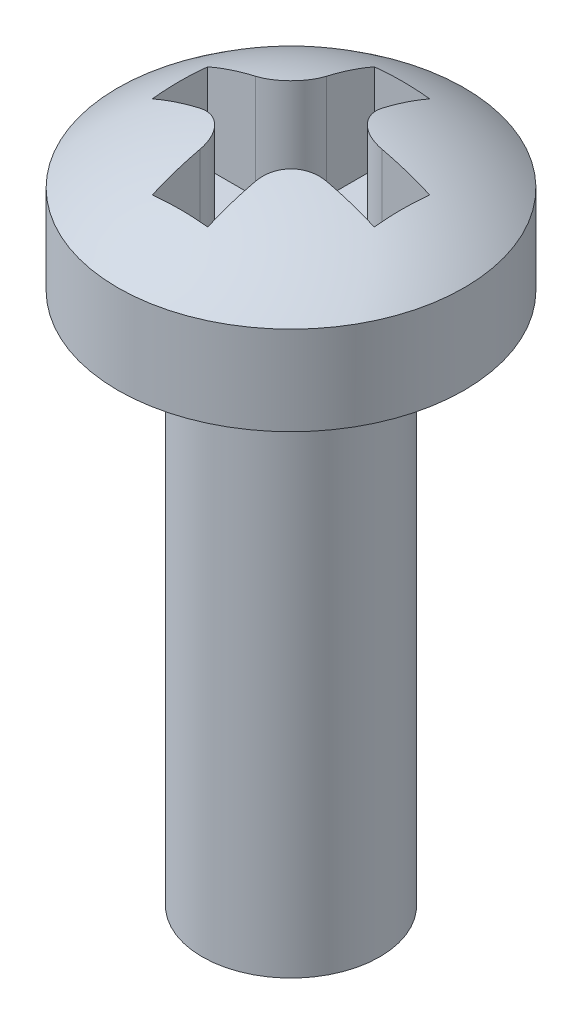
ISO-10303-21;
HEADER;
FILE_DESCRIPTION(('STEP AP214'),'2;1');
FILE_NAME('part.step','',(''),(''),'','','');
FILE_SCHEMA(('AUTOMOTIVE_DESIGN { 1 0 10303 214 1 1 1 1 }'));
ENDSEC;
DATA;
#1=APPLICATION_CONTEXT('core data for automotive mechanical design processes');
#2=APPLICATION_PROTOCOL_DEFINITION('international standard','automotive_design',2000,#1);
#3=PRODUCT_CONTEXT('',#1,'mechanical');
#4=PRODUCT('Part','Part','',(#3));
#5=PRODUCT_RELATED_PRODUCT_CATEGORY('part','',(#4));
#6=PRODUCT_DEFINITION_FORMATION('','',#4);
#7=PRODUCT_DEFINITION_CONTEXT('part definition',#1,'design');
#8=PRODUCT_DEFINITION('design','',#6,#7);
#9=PRODUCT_DEFINITION_SHAPE('','',#8);
#10=(LENGTH_UNIT() NAMED_UNIT(*) SI_UNIT(.MILLI.,.METRE.));
#11=(NAMED_UNIT(*) PLANE_ANGLE_UNIT() SI_UNIT($,.RADIAN.));
#12=(NAMED_UNIT(*) SI_UNIT($,.STERADIAN.) SOLID_ANGLE_UNIT());
#13=UNCERTAINTY_MEASURE_WITH_UNIT(LENGTH_MEASURE(1.E-05),#10,'distance_accuracy_value','');
#14=(GEOMETRIC_REPRESENTATION_CONTEXT(3) GLOBAL_UNCERTAINTY_ASSIGNED_CONTEXT((#13)) GLOBAL_UNIT_ASSIGNED_CONTEXT((#10,
#11,#12)) REPRESENTATION_CONTEXT('',''));
#15=CARTESIAN_POINT('',(0.,0.,0.));
#16=DIRECTION('',(0.,0.,1.));
#17=DIRECTION('',(1.,0.,0.));
#18=AXIS2_PLACEMENT_3D('',#15,#16,#17);
#19=CARTESIAN_POINT('',(0.,12.,0.));
#20=DIRECTION('',(0.,-1.,0.));
#21=DIRECTION('',(0.,0.,-1.));
#22=AXIS2_PLACEMENT_3D('',#19,#20,#21);
#23=CYLINDRICAL_SURFACE('',#22,2.);
#24=CARTESIAN_POINT('',(0.,12.,0.));
#25=DIRECTION('',(0.,1.,0.));
#26=DIRECTION('',(0.,0.,1.));
#27=AXIS2_PLACEMENT_3D('',#24,#25,#26);
#28=CIRCLE('',#27,2.);
#29=CARTESIAN_POINT('',(0.,12.,2.));
#30=VERTEX_POINT('',#29);
#31=EDGE_CURVE('E196',#30,#30,#28,.T.);
#32=ORIENTED_EDGE('',*,*,#31,.F.);
#33=EDGE_LOOP('',(#32));
#34=FACE_BOUND('',#33,.T.);
#35=CARTESIAN_POINT('',(0.,0.,0.));
#36=DIRECTION('',(0.,1.,0.));
#37=DIRECTION('',(0.,0.,1.));
#38=AXIS2_PLACEMENT_3D('',#35,#36,#37);
#39=CIRCLE('',#38,2.);
#40=CARTESIAN_POINT('',(0.,0.,2.));
#41=VERTEX_POINT('',#40);
#42=EDGE_CURVE('E194',#41,#41,#39,.T.);
#43=ORIENTED_EDGE('',*,*,#42,.T.);
#44=EDGE_LOOP('',(#43));
#45=FACE_BOUND('',#44,.T.);
#46=ADVANCED_FACE('F41',(#34,#45),#23,.T.);
#47=CARTESIAN_POINT('',(0.,0.,0.));
#48=DIRECTION('',(0.,1.,0.));
#49=DIRECTION('',(0.,0.,1.));
#50=AXIS2_PLACEMENT_3D('',#47,#48,#49);
#51=PLANE('',#50);
#52=ORIENTED_EDGE('',*,*,#42,.F.);
#53=EDGE_LOOP('',(#52));
#54=FACE_BOUND('',#53,.T.);
#55=ADVANCED_FACE('F240',(#54),#51,.F.);
#56=CARTESIAN_POINT('',(0.,14.,0.));
#57=DIRECTION('',(0.,-1.,0.));
#58=DIRECTION('',(0.,0.,-1.));
#59=AXIS2_PLACEMENT_3D('',#56,#57,#58);
#60=CYLINDRICAL_SURFACE('',#59,3.9);
#61=CARTESIAN_POINT('',(0.,14.,0.));
#62=DIRECTION('',(0.,1.,0.));
#63=DIRECTION('',(0.,0.,1.));
#64=AXIS2_PLACEMENT_3D('',#61,#62,#63);
#65=CIRCLE('',#64,3.9);
#66=CARTESIAN_POINT('',(0.,14.,3.9));
#67=VERTEX_POINT('',#66);
#68=EDGE_CURVE('E186',#67,#67,#65,.T.);
#69=ORIENTED_EDGE('',*,*,#68,.F.);
#70=EDGE_LOOP('',(#69));
#71=FACE_BOUND('',#70,.T.);
#72=CARTESIAN_POINT('',(0.,12.,0.));
#73=DIRECTION('',(0.,1.,0.));
#74=DIRECTION('',(0.,0.,1.));
#75=AXIS2_PLACEMENT_3D('',#72,#73,#74);
#76=CIRCLE('',#75,3.9);
#77=CARTESIAN_POINT('',(0.,12.,3.9));
#78=VERTEX_POINT('',#77);
#79=EDGE_CURVE('E181',#78,#78,#76,.T.);
#80=ORIENTED_EDGE('',*,*,#79,.T.);
#81=EDGE_LOOP('',(#80));
#82=FACE_BOUND('',#81,.T.);
#83=ADVANCED_FACE('F245',(#71,#82),#60,.T.);
#84=CARTESIAN_POINT('',(0.,12.,0.));
#85=DIRECTION('',(0.,1.,0.));
#86=DIRECTION('',(0.,0.,1.));
#87=AXIS2_PLACEMENT_3D('',#84,#85,#86);
#88=PLANE('',#87);
#89=ORIENTED_EDGE('',*,*,#31,.T.);
#90=EDGE_LOOP('',(#89));
#91=FACE_BOUND('',#90,.T.);
#92=ORIENTED_EDGE('',*,*,#79,.F.);
#93=EDGE_LOOP('',(#92));
#94=FACE_BOUND('',#93,.T.);
#95=ADVANCED_FACE('F237',(#91,#94),#88,.F.);
#96=CARTESIAN_POINT('',(0.,9.02269820465152,0.));
#97=DIRECTION('',(0.,1.,0.));
#98=DIRECTION('',(0.,0.,-1.));
#99=AXIS2_PLACEMENT_3D('',#96,#97,#98);
#100=SPHERICAL_SURFACE('',#99,6.32325336847886);
#101=CARTESIAN_POINT('',(0.,9.02269820465152,0.625));
#102=DIRECTION('',(0.,0.,1.));
#103=DIRECTION('',(1.,0.,0.));
#104=AXIS2_PLACEMENT_3D('',#101,#102,#103);
#105=CIRCLE('',#104,6.29228958027038);
#106=CARTESIAN_POINT('',(-1.42500000000001,15.1515058506769,0.625));
#107=VERTEX_POINT('',#106);
#108=CARTESIAN_POINT('',(-2.5,14.7970300414946,0.625));
#109=VERTEX_POINT('',#108);
#110=EDGE_CURVE('E174',#107,#109,#105,.T.);
#111=ORIENTED_EDGE('',*,*,#110,.T.);
#112=CARTESIAN_POINT('',(-2.5,9.02269820465152,0.));
#113=DIRECTION('',(-1.,0.,0.));
#114=DIRECTION('',(0.,0.,1.));
#115=AXIS2_PLACEMENT_3D('',#112,#113,#114);
#116=CIRCLE('',#115,5.80805760663401);
#117=CARTESIAN_POINT('',(-2.5,14.7970300414946,-0.625));
#118=VERTEX_POINT('',#117);
#119=EDGE_CURVE('E12',#109,#118,#116,.T.);
#120=ORIENTED_EDGE('',*,*,#119,.T.);
#121=CARTESIAN_POINT('',(0.,9.02269820465152,-0.625));
#122=DIRECTION('',(0.,0.,-1.));
#123=DIRECTION('',(-1.,0.,0.));
#124=AXIS2_PLACEMENT_3D('',#121,#122,#123);
#125=CIRCLE('',#124,6.29228958027038);
#126=CARTESIAN_POINT('',(-1.42500000000001,15.1515058506769,-0.625));
#127=VERTEX_POINT('',#126);
#128=EDGE_CURVE('E49',#118,#127,#125,.T.);
#129=ORIENTED_EDGE('',*,*,#128,.T.);
#130=CARTESIAN_POINT('',(-1.4252,15.1514593429836,-0.625000025));
#131=CARTESIAN_POINT('',(-1.38184374378188,15.1615518928981,-0.624948561174054));
#132=CARTESIAN_POINT('',(-1.33827583955659,15.1708309013409,-0.62850182043144));
#133=CARTESIAN_POINT('',(-1.25192646159068,15.187524179264,-0.642731213122102));
#134=CARTESIAN_POINT('',(-1.20914551830458,15.194937230813,-0.653411982244613));
#135=CARTESIAN_POINT('',(-1.12557346005425,15.2076572101327,-0.681832101681096));
#136=CARTESIAN_POINT('',(-1.08478559767837,15.2129607898567,-0.699582584042711));
#137=CARTESIAN_POINT('',(-1.00656546410532,15.2212634159568,-0.741711700844041));
#138=CARTESIAN_POINT('',(-0.969130777433283,15.2242641331961,-0.766085512246421));
#139=CARTESIAN_POINT('',(-0.899716144684693,15.2278120306602,-0.820055305639437));
#140=CARTESIAN_POINT('',(-0.867616772310629,15.2284228944728,-0.8494935878847));
#141=CARTESIAN_POINT('',(-0.808632580621051,15.2273462865016,-0.91316588657738));
#142=CARTESIAN_POINT('',(-0.781747952792535,15.2256587303372,-0.947400079052605));
#143=CARTESIAN_POINT('',(-0.73426498319073,15.2200807200627,-1.01915279476468));
#144=CARTESIAN_POINT('',(-0.713587732684963,15.2162198859051,-1.05662153797908));
#145=CARTESIAN_POINT('',(-0.678528636134538,15.2064396302904,-1.1341551933627));
#146=CARTESIAN_POINT('',(-0.664147859944128,15.2005198592992,-1.17422054540342));
#147=CARTESIAN_POINT('',(-0.643679078751315,15.1878713431403,-1.24946363396399));
#148=CARTESIAN_POINT('',(-0.636650816866836,15.1814104705299,-1.28443564255663));
#149=CARTESIAN_POINT('',(-0.62730305973807,15.1672960619712,-1.35471445642602));
#150=CARTESIAN_POINT('',(-0.624976794734124,15.1596442578137,-1.390020706733));
#151=CARTESIAN_POINT('',(-0.625000025000001,15.1514593429836,-1.4252));
#152=B_SPLINE_CURVE_WITH_KNOTS('',3,(#130,#131,#132,#133,#134,#135,#136,#137,#138,#139,#140,
#141,#142,#143,#144,#145,#146,#147,#148,#149,#150,#151),.UNSPECIFIED.,.F.,.F.,(4,2,2,2,2,2,2,2,
2,2,4),(0.,0.133427372911231,0.266941610866476,0.400666918258878,0.534295108056988,
0.664337164463102,0.79438399514927,0.922699878219043,1.05103755540116,1.15947032120704,
1.26774685803945),.UNSPECIFIED.);
#153=CARTESIAN_POINT('',(-0.625,15.1515058506769,-1.42500000000001));
#154=VERTEX_POINT('',#153);
#155=EDGE_CURVE('E424',#127,#154,#152,.T.);
#156=ORIENTED_EDGE('',*,*,#155,.T.);
#157=CARTESIAN_POINT('',(-0.625,9.02269820465152,0.));
#158=DIRECTION('',(-1.,0.,0.));
#159=DIRECTION('',(0.,0.,1.));
#160=AXIS2_PLACEMENT_3D('',#157,#158,#159);
#161=CIRCLE('',#160,6.29228958027038);
#162=CARTESIAN_POINT('',(-0.625,14.7970300414946,-2.5));
#163=VERTEX_POINT('',#162);
#164=EDGE_CURVE('E432',#154,#163,#161,.T.);
#165=ORIENTED_EDGE('',*,*,#164,.T.);
#166=CARTESIAN_POINT('',(0.,9.02269820465152,-2.5));
#167=DIRECTION('',(0.,0.,-1.));
#168=DIRECTION('',(-1.,0.,0.));
#169=AXIS2_PLACEMENT_3D('',#166,#167,#168);
#170=CIRCLE('',#169,5.80805760663401);
#171=CARTESIAN_POINT('',(0.625,14.7970300414946,-2.5));
#172=VERTEX_POINT('',#171);
#173=EDGE_CURVE('E525',#163,#172,#170,.T.);
#174=ORIENTED_EDGE('',*,*,#173,.T.);
#175=CARTESIAN_POINT('',(0.625,9.02269820465152,0.));
#176=DIRECTION('',(1.,0.,0.));
#177=DIRECTION('',(0.,0.,-1.));
#178=AXIS2_PLACEMENT_3D('',#175,#176,#177);
#179=CIRCLE('',#178,6.29228958027038);
#180=CARTESIAN_POINT('',(0.625,15.1515058506769,-1.42500000000001));
#181=VERTEX_POINT('',#180);
#182=EDGE_CURVE('E521',#172,#181,#179,.T.);
#183=ORIENTED_EDGE('',*,*,#182,.T.);
#184=CARTESIAN_POINT('',(0.625000025,15.1514593429836,-1.4252));
#185=CARTESIAN_POINT('',(0.624948561174054,15.1615518928981,-1.38184374378188));
#186=CARTESIAN_POINT('',(0.62850182043144,15.1708309013409,-1.33827583955659));
#187=CARTESIAN_POINT('',(0.642731213122102,15.187524179264,-1.25192646159068));
#188=CARTESIAN_POINT('',(0.653411982244613,15.194937230813,-1.20914551830458));
#189=CARTESIAN_POINT('',(0.681832101681096,15.2076572101327,-1.12557346005425));
#190=CARTESIAN_POINT('',(0.699582584042711,15.2129607898567,-1.08478559767837));
#191=CARTESIAN_POINT('',(0.741711700844041,15.2212634159568,-1.00656546410532));
#192=CARTESIAN_POINT('',(0.766085512246421,15.2242641331961,-0.969130777433283));
#193=CARTESIAN_POINT('',(0.820055305639437,15.2278120306602,-0.899716144684693));
#194=CARTESIAN_POINT('',(0.8494935878847,15.2284228944728,-0.867616772310629));
#195=CARTESIAN_POINT('',(0.91316588657738,15.2273462865016,-0.808632580621051));
#196=CARTESIAN_POINT('',(0.947400079052605,15.2256587303372,-0.781747952792535));
#197=CARTESIAN_POINT('',(1.01915279476468,15.2200807200627,-0.73426498319073));
#198=CARTESIAN_POINT('',(1.05662153797908,15.2162198859051,-0.713587732684963));
#199=CARTESIAN_POINT('',(1.1341551933627,15.2064396302904,-0.678528636134538));
#200=CARTESIAN_POINT('',(1.17422054540342,15.2005198592992,-0.664147859944128));
#201=CARTESIAN_POINT('',(1.24946363396399,15.1878713431403,-0.643679078751315));
#202=CARTESIAN_POINT('',(1.28443564255663,15.1814104705299,-0.636650816866836));
#203=CARTESIAN_POINT('',(1.35471445642602,15.1672960619712,-0.62730305973807));
#204=CARTESIAN_POINT('',(1.390020706733,15.1596442578137,-0.624976794734124));
#205=CARTESIAN_POINT('',(1.4252,15.1514593429836,-0.625000025000001));
#206=B_SPLINE_CURVE_WITH_KNOTS('',3,(#184,#185,#186,#187,#188,#189,#190,#191,#192,#193,#194,
#195,#196,#197,#198,#199,#200,#201,#202,#203,#204,#205),.UNSPECIFIED.,.F.,.F.,(4,2,2,2,2,2,2,2,
2,2,4),(0.,0.133427372911231,0.266941610866476,0.400666918258878,0.534295108056988,
0.664337164463102,0.79438399514927,0.922699878219043,1.05103755540116,1.15947032120704,
1.26774685803945),.UNSPECIFIED.);
#207=CARTESIAN_POINT('',(1.42500000000001,15.1515058506769,-0.625));
#208=VERTEX_POINT('',#207);
#209=EDGE_CURVE('E512',#181,#208,#206,.T.);
#210=ORIENTED_EDGE('',*,*,#209,.T.);
#211=CARTESIAN_POINT('',(0.,9.02269820465152,-0.625));
#212=DIRECTION('',(0.,0.,-1.));
#213=DIRECTION('',(-1.,0.,0.));
#214=AXIS2_PLACEMENT_3D('',#211,#212,#213);
#215=CIRCLE('',#214,6.29228958027038);
#216=CARTESIAN_POINT('',(2.5,14.7970300414946,-0.625));
#217=VERTEX_POINT('',#216);
#218=EDGE_CURVE('E522',#208,#217,#215,.T.);
#219=ORIENTED_EDGE('',*,*,#218,.T.);
#220=CARTESIAN_POINT('',(2.5,9.02269820465152,0.));
#221=DIRECTION('',(1.,0.,0.));
#222=DIRECTION('',(0.,0.,-1.));
#223=AXIS2_PLACEMENT_3D('',#220,#221,#222);
#224=CIRCLE('',#223,5.80805760663401);
#225=CARTESIAN_POINT('',(2.5,14.7970300414946,0.625));
#226=VERTEX_POINT('',#225);
#227=EDGE_CURVE('E582',#217,#226,#224,.T.);
#228=ORIENTED_EDGE('',*,*,#227,.T.);
#229=CARTESIAN_POINT('',(0.,9.02269820465152,0.625));
#230=DIRECTION('',(0.,0.,1.));
#231=DIRECTION('',(1.,0.,0.));
#232=AXIS2_PLACEMENT_3D('',#229,#230,#231);
#233=CIRCLE('',#232,6.29228958027038);
#234=CARTESIAN_POINT('',(1.425,15.1515058506769,0.625));
#235=VERTEX_POINT('',#234);
#236=EDGE_CURVE('E507',#226,#235,#233,.T.);
#237=ORIENTED_EDGE('',*,*,#236,.T.);
#238=CARTESIAN_POINT('',(1.4252,15.1514593429836,0.625000025));
#239=CARTESIAN_POINT('',(1.38184374378188,15.1615518928981,0.624948561174054));
#240=CARTESIAN_POINT('',(1.33827583955659,15.1708309013409,0.62850182043144));
#241=CARTESIAN_POINT('',(1.25192646159067,15.187524179264,0.642731213122103));
#242=CARTESIAN_POINT('',(1.20914551830458,15.194937230813,0.653411982244614));
#243=CARTESIAN_POINT('',(1.12557346005424,15.2076572101327,0.681832101681098));
#244=CARTESIAN_POINT('',(1.08478559767836,15.2129607898567,0.699582584042714));
#245=CARTESIAN_POINT('',(1.00656546410532,15.2212634159568,0.741711700844044));
#246=CARTESIAN_POINT('',(0.969130777433279,15.2242641331961,0.766085512246425));
#247=CARTESIAN_POINT('',(0.899716144684689,15.2278120306602,0.820055305639441));
#248=CARTESIAN_POINT('',(0.867616772310625,15.2284228944728,0.849493587884704));
#249=CARTESIAN_POINT('',(0.808632580621047,15.2273462865016,0.913165886577384));
#250=CARTESIAN_POINT('',(0.781747952792532,15.2256587303372,0.947400079052609));
#251=CARTESIAN_POINT('',(0.734264983190728,15.2200807200627,1.01915279476468));
#252=CARTESIAN_POINT('',(0.71358773268496,15.2162198859051,1.05662153797909));
#253=CARTESIAN_POINT('',(0.678528636134536,15.2064396302904,1.13415519336271));
#254=CARTESIAN_POINT('',(0.664147859944127,15.2005198592992,1.17422054540343));
#255=CARTESIAN_POINT('',(0.643679078751314,15.1878713431403,1.249463633964));
#256=CARTESIAN_POINT('',(0.636650816866836,15.1814104705299,1.28443564255663));
#257=CARTESIAN_POINT('',(0.627303059738071,15.1672960619712,1.35471445642602));
#258=CARTESIAN_POINT('',(0.624976794734125,15.1596442578137,1.390020706733));
#259=CARTESIAN_POINT('',(0.625000025000001,15.1514593429836,1.4252));
#260=B_SPLINE_CURVE_WITH_KNOTS('',3,(#238,#239,#240,#241,#242,#243,#244,#245,#246,#247,#248,
#249,#250,#251,#252,#253,#254,#255,#256,#257,#258,#259),.UNSPECIFIED.,.F.,.F.,(4,2,2,2,2,2,2,2,
2,2,4),(0.,0.133427372911231,0.266941610866476,0.400666918258878,0.534295108056989,
0.664337164463103,0.79438399514927,0.922699878219044,1.05103755540116,1.15947032120703,
1.26774685803944),.UNSPECIFIED.);
#261=CARTESIAN_POINT('',(0.625,15.1515058506769,1.42500000000001));
#262=VERTEX_POINT('',#261);
#263=EDGE_CURVE('E497',#235,#262,#260,.T.);
#264=ORIENTED_EDGE('',*,*,#263,.T.);
#265=CARTESIAN_POINT('',(0.625000000000001,9.02269820465152,0.));
#266=DIRECTION('',(1.,0.,0.));
#267=DIRECTION('',(0.,0.,-1.));
#268=AXIS2_PLACEMENT_3D('',#265,#266,#267);
#269=CIRCLE('',#268,6.29228958027038);
#270=CARTESIAN_POINT('',(0.625,14.7970300414946,2.5));
#271=VERTEX_POINT('',#270);
#272=EDGE_CURVE('E495',#262,#271,#269,.T.);
#273=ORIENTED_EDGE('',*,*,#272,.T.);
#274=CARTESIAN_POINT('',(0.,9.02269820465152,2.5));
#275=DIRECTION('',(0.,0.,1.));
#276=DIRECTION('',(1.,0.,0.));
#277=AXIS2_PLACEMENT_3D('',#274,#275,#276);
#278=CIRCLE('',#277,5.80805760663401);
#279=CARTESIAN_POINT('',(-0.625,14.7970300414946,2.5));
#280=VERTEX_POINT('',#279);
#281=EDGE_CURVE('E492',#271,#280,#278,.T.);
#282=ORIENTED_EDGE('',*,*,#281,.T.);
#283=CARTESIAN_POINT('',(-0.625,9.02269820465152,0.));
#284=DIRECTION('',(-1.,0.,0.));
#285=DIRECTION('',(0.,0.,1.));
#286=AXIS2_PLACEMENT_3D('',#283,#284,#285);
#287=CIRCLE('',#286,6.29228958027038);
#288=CARTESIAN_POINT('',(-0.625,15.1515058506769,1.42500000000001));
#289=VERTEX_POINT('',#288);
#290=EDGE_CURVE('E214',#280,#289,#287,.T.);
#291=ORIENTED_EDGE('',*,*,#290,.T.);
#292=CARTESIAN_POINT('',(-0.625000025,15.1514593429836,1.4252));
#293=CARTESIAN_POINT('',(-0.624948561174054,15.1615518928981,1.38184374378188));
#294=CARTESIAN_POINT('',(-0.62850182043144,15.1708309013409,1.33827583955659));
#295=CARTESIAN_POINT('',(-0.642731213122102,15.187524179264,1.25192646159068));
#296=CARTESIAN_POINT('',(-0.653411982244613,15.194937230813,1.20914551830458));
#297=CARTESIAN_POINT('',(-0.681832101681096,15.2076572101327,1.12557346005425));
#298=CARTESIAN_POINT('',(-0.699582584042711,15.2129607898567,1.08478559767837));
#299=CARTESIAN_POINT('',(-0.741711700844041,15.2212634159568,1.00656546410532));
#300=CARTESIAN_POINT('',(-0.766085512246421,15.2242641331961,0.969130777433283));
#301=CARTESIAN_POINT('',(-0.820055305639437,15.2278120306602,0.899716144684693));
#302=CARTESIAN_POINT('',(-0.8494935878847,15.2284228944728,0.867616772310629));
#303=CARTESIAN_POINT('',(-0.91316588657738,15.2273462865016,0.808632580621051));
#304=CARTESIAN_POINT('',(-0.947400079052605,15.2256587303372,0.781747952792535));
#305=CARTESIAN_POINT('',(-1.01915279476468,15.2200807200627,0.73426498319073));
#306=CARTESIAN_POINT('',(-1.05662153797908,15.2162198859051,0.713587732684963));
#307=CARTESIAN_POINT('',(-1.1341551933627,15.2064396302904,0.678528636134538));
#308=CARTESIAN_POINT('',(-1.17422054540342,15.2005198592992,0.664147859944128));
#309=CARTESIAN_POINT('',(-1.24946363396399,15.1878713431403,0.643679078751315));
#310=CARTESIAN_POINT('',(-1.28443564255663,15.1814104705299,0.636650816866836));
#311=CARTESIAN_POINT('',(-1.35471445642602,15.1672960619712,0.62730305973807));
#312=CARTESIAN_POINT('',(-1.390020706733,15.1596442578137,0.624976794734124));
#313=CARTESIAN_POINT('',(-1.4252,15.1514593429836,0.625000025000001));
#314=B_SPLINE_CURVE_WITH_KNOTS('',3,(#292,#293,#294,#295,#296,#297,#298,#299,#300,#301,#302,
#303,#304,#305,#306,#307,#308,#309,#310,#311,#312,#313),.UNSPECIFIED.,.F.,.F.,(4,2,2,2,2,2,2,2,
2,2,4),(0.,0.133427372911231,0.266941610866476,0.400666918258878,0.534295108056988,
0.664337164463102,0.79438399514927,0.922699878219043,1.05103755540116,1.15947032120704,
1.26774685803945),.UNSPECIFIED.);
#315=EDGE_CURVE('E205',#289,#107,#314,.T.);
#316=ORIENTED_EDGE('',*,*,#315,.T.);
#317=EDGE_LOOP('',(#111,#120,#129,#156,#165,#174,#183,#210,#219,#228,#237,#264,#273,#282,#291,#316));
#318=FACE_BOUND('',#317,.T.);
#319=ORIENTED_EDGE('',*,*,#68,.T.);
#320=EDGE_LOOP('',(#319));
#321=FACE_BOUND('',#320,.T.);
#322=ADVANCED_FACE('F216',(#318,#321),#100,.T.);
#323=CARTESIAN_POINT('',(-2.5,4.92893218813452,-0.625));
#324=DIRECTION('',(-1.,0.,0.));
#325=DIRECTION('',(0.,0.,1.));
#326=AXIS2_PLACEMENT_3D('',#323,#324,#325);
#327=PLANE('',#326);
#328=DIRECTION('',(0.,1.,0.));
#329=VECTOR('',#328,1.);
#330=CARTESIAN_POINT('',(-2.5,4.92893218813452,0.625));
#331=LINE('',#330,#329);
#332=CARTESIAN_POINT('',(-2.5,12.8,0.625));
#333=VERTEX_POINT('',#332);
#334=EDGE_CURVE('E56',#333,#109,#331,.T.);
#335=ORIENTED_EDGE('',*,*,#334,.F.);
#336=DIRECTION('',(0.,0.,-1.));
#337=VECTOR('',#336,1.);
#338=CARTESIAN_POINT('',(-2.5,12.8,-0.625));
#339=LINE('',#338,#337);
#340=CARTESIAN_POINT('',(-2.5,12.8,-0.625));
#341=VERTEX_POINT('',#340);
#342=EDGE_CURVE('E179',#333,#341,#339,.T.);
#343=ORIENTED_EDGE('',*,*,#342,.T.);
#344=DIRECTION('',(0.,1.,0.));
#345=VECTOR('',#344,1.);
#346=CARTESIAN_POINT('',(-2.5,4.92893218813452,-0.625));
#347=LINE('',#346,#345);
#348=EDGE_CURVE('E168',#341,#118,#347,.T.);
#349=ORIENTED_EDGE('',*,*,#348,.T.);
#350=ORIENTED_EDGE('',*,*,#119,.F.);
#351=EDGE_LOOP('',(#335,#343,#349,#350));
#352=FACE_BOUND('',#351,.T.);
#353=ADVANCED_FACE('F227',(#352),#327,.F.);
#354=CARTESIAN_POINT('',(-2.5,4.92893218813452,-0.625));
#355=DIRECTION('',(0.,0.,-1.));
#356=DIRECTION('',(-1.,0.,0.));
#357=AXIS2_PLACEMENT_3D('',#354,#355,#356);
#358=PLANE('',#357);
#359=ORIENTED_EDGE('',*,*,#348,.F.);
#360=DIRECTION('',(1.,0.,0.));
#361=VECTOR('',#360,1.);
#362=CARTESIAN_POINT('',(-2.5,12.8,-0.625));
#363=LINE('',#362,#361);
#364=CARTESIAN_POINT('',(-1.425,12.8,-0.625));
#365=VERTEX_POINT('',#364);
#366=EDGE_CURVE('E188',#341,#365,#363,.T.);
#367=ORIENTED_EDGE('',*,*,#366,.T.);
#368=DIRECTION('',(0.,1.,0.));
#369=VECTOR('',#368,1.);
#370=CARTESIAN_POINT('',(-1.42500000000001,4.92893218813452,-0.625));
#371=LINE('',#370,#369);
#372=EDGE_CURVE('E437',#365,#127,#371,.T.);
#373=ORIENTED_EDGE('',*,*,#372,.T.);
#374=ORIENTED_EDGE('',*,*,#128,.F.);
#375=EDGE_LOOP('',(#359,#367,#373,#374));
#376=FACE_BOUND('',#375,.T.);
#377=ADVANCED_FACE('F229',(#376),#358,.F.);
#378=CARTESIAN_POINT('',(-1.425,4.92893218813452,-1.425));
#379=DIRECTION('',(0.,1.,0.));
#380=DIRECTION('',(0.,0.,1.));
#381=AXIS2_PLACEMENT_3D('',#378,#379,#380);
#382=CYLINDRICAL_SURFACE('',#381,0.8);
#383=ORIENTED_EDGE('',*,*,#372,.F.);
#384=CARTESIAN_POINT('',(-1.425,12.8,-1.425));
#385=DIRECTION('',(0.,1.,0.));
#386=DIRECTION('',(0.,0.,1.));
#387=AXIS2_PLACEMENT_3D('',#384,#385,#386);
#388=CIRCLE('',#387,0.8);
#389=CARTESIAN_POINT('',(-0.625,12.8,-1.42500000000001));
#390=VERTEX_POINT('',#389);
#391=EDGE_CURVE('E533',#365,#390,#388,.T.);
#392=ORIENTED_EDGE('',*,*,#391,.T.);
#393=DIRECTION('',(0.,1.,0.));
#394=VECTOR('',#393,1.);
#395=CARTESIAN_POINT('',(-0.625,4.92893218813452,-1.42500000000001));
#396=LINE('',#395,#394);
#397=EDGE_CURVE('E440',#390,#154,#396,.T.);
#398=ORIENTED_EDGE('',*,*,#397,.T.);
#399=ORIENTED_EDGE('',*,*,#155,.F.);
#400=EDGE_LOOP('',(#383,#392,#398,#399));
#401=FACE_BOUND('',#400,.T.);
#402=ADVANCED_FACE('F235',(#401),#382,.T.);
#403=CARTESIAN_POINT('',(-0.625,4.92893218813452,-2.5));
#404=DIRECTION('',(-1.,0.,0.));
#405=DIRECTION('',(0.,0.,1.));
#406=AXIS2_PLACEMENT_3D('',#403,#404,#405);
#407=PLANE('',#406);
#408=ORIENTED_EDGE('',*,*,#397,.F.);
#409=DIRECTION('',(0.,0.,-1.));
#410=VECTOR('',#409,1.);
#411=CARTESIAN_POINT('',(-0.625,12.8,-2.5));
#412=LINE('',#411,#410);
#413=CARTESIAN_POINT('',(-0.625,12.8,-2.5));
#414=VERTEX_POINT('',#413);
#415=EDGE_CURVE('E536',#390,#414,#412,.T.);
#416=ORIENTED_EDGE('',*,*,#415,.T.);
#417=DIRECTION('',(0.,1.,0.));
#418=VECTOR('',#417,1.);
#419=CARTESIAN_POINT('',(-0.625,4.92893218813452,-2.5));
#420=LINE('',#419,#418);
#421=EDGE_CURVE('E447',#414,#163,#420,.T.);
#422=ORIENTED_EDGE('',*,*,#421,.T.);
#423=ORIENTED_EDGE('',*,*,#164,.F.);
#424=EDGE_LOOP('',(#408,#416,#422,#423));
#425=FACE_BOUND('',#424,.T.);
#426=ADVANCED_FACE('F291',(#425),#407,.F.);
#427=CARTESIAN_POINT('',(0.625,4.92893218813452,-2.5));
#428=DIRECTION('',(0.,0.,-1.));
#429=DIRECTION('',(-1.,0.,0.));
#430=AXIS2_PLACEMENT_3D('',#427,#428,#429);
#431=PLANE('',#430);
#432=ORIENTED_EDGE('',*,*,#421,.F.);
#433=DIRECTION('',(1.,0.,0.));
#434=VECTOR('',#433,1.);
#435=CARTESIAN_POINT('',(0.625,12.8,-2.5));
#436=LINE('',#435,#434);
#437=CARTESIAN_POINT('',(0.625,12.8,-2.5));
#438=VERTEX_POINT('',#437);
#439=EDGE_CURVE('E540',#414,#438,#436,.T.);
#440=ORIENTED_EDGE('',*,*,#439,.T.);
#441=DIRECTION('',(0.,1.,0.));
#442=VECTOR('',#441,1.);
#443=CARTESIAN_POINT('',(0.625,4.92893218813452,-2.5));
#444=LINE('',#443,#442);
#445=EDGE_CURVE('E451',#438,#172,#444,.T.);
#446=ORIENTED_EDGE('',*,*,#445,.T.);
#447=ORIENTED_EDGE('',*,*,#173,.F.);
#448=EDGE_LOOP('',(#432,#440,#446,#447));
#449=FACE_BOUND('',#448,.T.);
#450=ADVANCED_FACE('F301',(#449),#431,.F.);
#451=CARTESIAN_POINT('',(0.625,4.92893218813452,-2.5));
#452=DIRECTION('',(1.,0.,0.));
#453=DIRECTION('',(0.,0.,-1.));
#454=AXIS2_PLACEMENT_3D('',#451,#452,#453);
#455=PLANE('',#454);
#456=ORIENTED_EDGE('',*,*,#445,.F.);
#457=DIRECTION('',(0.,0.,1.));
#458=VECTOR('',#457,1.);
#459=CARTESIAN_POINT('',(0.625,12.8,-2.5));
#460=LINE('',#459,#458);
#461=CARTESIAN_POINT('',(0.625,12.8,-1.42500000000001));
#462=VERTEX_POINT('',#461);
#463=EDGE_CURVE('E544',#438,#462,#460,.T.);
#464=ORIENTED_EDGE('',*,*,#463,.T.);
#465=DIRECTION('',(0.,1.,0.));
#466=VECTOR('',#465,1.);
#467=CARTESIAN_POINT('',(0.625,4.92893218813452,-1.42500000000001));
#468=LINE('',#467,#466);
#469=EDGE_CURVE('E455',#462,#181,#468,.T.);
#470=ORIENTED_EDGE('',*,*,#469,.T.);
#471=ORIENTED_EDGE('',*,*,#182,.F.);
#472=EDGE_LOOP('',(#456,#464,#470,#471));
#473=FACE_BOUND('',#472,.T.);
#474=ADVANCED_FACE('F311',(#473),#455,.F.);
#475=CARTESIAN_POINT('',(1.425,4.92893218813452,-1.425));
#476=DIRECTION('',(0.,1.,0.));
#477=DIRECTION('',(0.,0.,1.));
#478=AXIS2_PLACEMENT_3D('',#475,#476,#477);
#479=CYLINDRICAL_SURFACE('',#478,0.8);
#480=ORIENTED_EDGE('',*,*,#469,.F.);
#481=CARTESIAN_POINT('',(1.425,12.8,-1.425));
#482=DIRECTION('',(0.,1.,0.));
#483=DIRECTION('',(0.,0.,1.));
#484=AXIS2_PLACEMENT_3D('',#481,#482,#483);
#485=CIRCLE('',#484,0.8);
#486=CARTESIAN_POINT('',(1.42500000000001,12.8,-0.625));
#487=VERTEX_POINT('',#486);
#488=EDGE_CURVE('E550',#462,#487,#485,.T.);
#489=ORIENTED_EDGE('',*,*,#488,.T.);
#490=DIRECTION('',(0.,1.,0.));
#491=VECTOR('',#490,1.);
#492=CARTESIAN_POINT('',(1.42500000000001,4.92893218813452,-0.625));
#493=LINE('',#492,#491);
#494=EDGE_CURVE('E459',#487,#208,#493,.T.);
#495=ORIENTED_EDGE('',*,*,#494,.T.);
#496=ORIENTED_EDGE('',*,*,#209,.F.);
#497=EDGE_LOOP('',(#480,#489,#495,#496));
#498=FACE_BOUND('',#497,.T.);
#499=ADVANCED_FACE('F321',(#498),#479,.T.);
#500=CARTESIAN_POINT('',(1.42500000000001,4.92893218813452,-0.625));
#501=DIRECTION('',(0.,0.,-1.));
#502=DIRECTION('',(-1.,0.,0.));
#503=AXIS2_PLACEMENT_3D('',#500,#501,#502);
#504=PLANE('',#503);
#505=ORIENTED_EDGE('',*,*,#494,.F.);
#506=DIRECTION('',(1.,0.,0.));
#507=VECTOR('',#506,1.);
#508=CARTESIAN_POINT('',(1.42500000000001,12.8,-0.625));
#509=LINE('',#508,#507);
#510=CARTESIAN_POINT('',(2.5,12.8,-0.625));
#511=VERTEX_POINT('',#510);
#512=EDGE_CURVE('E553',#487,#511,#509,.T.);
#513=ORIENTED_EDGE('',*,*,#512,.T.);
#514=DIRECTION('',(0.,1.,0.));
#515=VECTOR('',#514,1.);
#516=CARTESIAN_POINT('',(2.5,4.92893218813452,-0.625));
#517=LINE('',#516,#515);
#518=EDGE_CURVE('E463',#511,#217,#517,.T.);
#519=ORIENTED_EDGE('',*,*,#518,.T.);
#520=ORIENTED_EDGE('',*,*,#218,.F.);
#521=EDGE_LOOP('',(#505,#513,#519,#520));
#522=FACE_BOUND('',#521,.T.);
#523=ADVANCED_FACE('F331',(#522),#504,.F.);
#524=CARTESIAN_POINT('',(2.5,4.92893218813452,-0.625));
#525=DIRECTION('',(1.,0.,0.));
#526=DIRECTION('',(0.,0.,-1.));
#527=AXIS2_PLACEMENT_3D('',#524,#525,#526);
#528=PLANE('',#527);
#529=ORIENTED_EDGE('',*,*,#518,.F.);
#530=DIRECTION('',(0.,0.,1.));
#531=VECTOR('',#530,1.);
#532=CARTESIAN_POINT('',(2.5,12.8,-0.625));
#533=LINE('',#532,#531);
#534=CARTESIAN_POINT('',(2.5,12.8,0.625));
#535=VERTEX_POINT('',#534);
#536=EDGE_CURVE('E556',#511,#535,#533,.T.);
#537=ORIENTED_EDGE('',*,*,#536,.T.);
#538=DIRECTION('',(0.,1.,0.));
#539=VECTOR('',#538,1.);
#540=CARTESIAN_POINT('',(2.5,4.92893218813452,0.625));
#541=LINE('',#540,#539);
#542=EDGE_CURVE('E467',#535,#226,#541,.T.);
#543=ORIENTED_EDGE('',*,*,#542,.T.);
#544=ORIENTED_EDGE('',*,*,#227,.F.);
#545=EDGE_LOOP('',(#529,#537,#543,#544));
#546=FACE_BOUND('',#545,.T.);
#547=ADVANCED_FACE('F341',(#546),#528,.F.);
#548=CARTESIAN_POINT('',(1.42500000000001,4.92893218813452,0.625));
#549=DIRECTION('',(0.,0.,1.));
#550=DIRECTION('',(1.,0.,0.));
#551=AXIS2_PLACEMENT_3D('',#548,#549,#550);
#552=PLANE('',#551);
#553=ORIENTED_EDGE('',*,*,#542,.F.);
#554=DIRECTION('',(-1.,0.,0.));
#555=VECTOR('',#554,1.);
#556=CARTESIAN_POINT('',(1.42500000000001,12.8,0.625));
#557=LINE('',#556,#555);
#558=CARTESIAN_POINT('',(1.425,12.8,0.625));
#559=VERTEX_POINT('',#558);
#560=EDGE_CURVE('E559',#535,#559,#557,.T.);
#561=ORIENTED_EDGE('',*,*,#560,.T.);
#562=DIRECTION('',(0.,1.,0.));
#563=VECTOR('',#562,1.);
#564=CARTESIAN_POINT('',(1.425,4.92893218813452,0.625));
#565=LINE('',#564,#563);
#566=EDGE_CURVE('E471',#559,#235,#565,.T.);
#567=ORIENTED_EDGE('',*,*,#566,.T.);
#568=ORIENTED_EDGE('',*,*,#236,.F.);
#569=EDGE_LOOP('',(#553,#561,#567,#568));
#570=FACE_BOUND('',#569,.T.);
#571=ADVANCED_FACE('F351',(#570),#552,.F.);
#572=CARTESIAN_POINT('',(1.425,4.92893218813452,1.425));
#573=DIRECTION('',(0.,1.,0.));
#574=DIRECTION('',(0.,0.,1.));
#575=AXIS2_PLACEMENT_3D('',#572,#573,#574);
#576=CYLINDRICAL_SURFACE('',#575,0.8);
#577=ORIENTED_EDGE('',*,*,#566,.F.);
#578=CARTESIAN_POINT('',(1.425,12.8,1.425));
#579=DIRECTION('',(0.,1.,0.));
#580=DIRECTION('',(0.,0.,1.));
#581=AXIS2_PLACEMENT_3D('',#578,#579,#580);
#582=CIRCLE('',#581,0.8);
#583=CARTESIAN_POINT('',(0.625,12.8,1.42500000000001));
#584=VERTEX_POINT('',#583);
#585=EDGE_CURVE('E562',#559,#584,#582,.T.);
#586=ORIENTED_EDGE('',*,*,#585,.T.);
#587=DIRECTION('',(0.,1.,0.));
#588=VECTOR('',#587,1.);
#589=CARTESIAN_POINT('',(0.625,4.92893218813452,1.42500000000001));
#590=LINE('',#589,#588);
#591=EDGE_CURVE('E475',#584,#262,#590,.T.);
#592=ORIENTED_EDGE('',*,*,#591,.T.);
#593=ORIENTED_EDGE('',*,*,#263,.F.);
#594=EDGE_LOOP('',(#577,#586,#592,#593));
#595=FACE_BOUND('',#594,.T.);
#596=ADVANCED_FACE('F361',(#595),#576,.T.);
#597=CARTESIAN_POINT('',(0.625,4.92893218813452,1.42500000000001));
#598=DIRECTION('',(1.,0.,0.));
#599=DIRECTION('',(0.,0.,-1.));
#600=AXIS2_PLACEMENT_3D('',#597,#598,#599);
#601=PLANE('',#600);
#602=ORIENTED_EDGE('',*,*,#591,.F.);
#603=DIRECTION('',(0.,0.,1.));
#604=VECTOR('',#603,1.);
#605=CARTESIAN_POINT('',(0.625,12.8,1.42500000000001));
#606=LINE('',#605,#604);
#607=CARTESIAN_POINT('',(0.625,12.8,2.5));
#608=VERTEX_POINT('',#607);
#609=EDGE_CURVE('E565',#584,#608,#606,.T.);
#610=ORIENTED_EDGE('',*,*,#609,.T.);
#611=DIRECTION('',(0.,1.,0.));
#612=VECTOR('',#611,1.);
#613=CARTESIAN_POINT('',(0.625,4.92893218813452,2.5));
#614=LINE('',#613,#612);
#615=EDGE_CURVE('E479',#608,#271,#614,.T.);
#616=ORIENTED_EDGE('',*,*,#615,.T.);
#617=ORIENTED_EDGE('',*,*,#272,.F.);
#618=EDGE_LOOP('',(#602,#610,#616,#617));
#619=FACE_BOUND('',#618,.T.);
#620=ADVANCED_FACE('F371',(#619),#601,.F.);
#621=CARTESIAN_POINT('',(0.625,4.92893218813452,2.5));
#622=DIRECTION('',(0.,0.,1.));
#623=DIRECTION('',(1.,0.,0.));
#624=AXIS2_PLACEMENT_3D('',#621,#622,#623);
#625=PLANE('',#624);
#626=ORIENTED_EDGE('',*,*,#615,.F.);
#627=DIRECTION('',(-1.,0.,0.));
#628=VECTOR('',#627,1.);
#629=CARTESIAN_POINT('',(0.625,12.8,2.5));
#630=LINE('',#629,#628);
#631=CARTESIAN_POINT('',(-0.625,12.8,2.5));
#632=VERTEX_POINT('',#631);
#633=EDGE_CURVE('E568',#608,#632,#630,.T.);
#634=ORIENTED_EDGE('',*,*,#633,.T.);
#635=DIRECTION('',(0.,1.,0.));
#636=VECTOR('',#635,1.);
#637=CARTESIAN_POINT('',(-0.625,4.92893218813452,2.5));
#638=LINE('',#637,#636);
#639=EDGE_CURVE('E483',#632,#280,#638,.T.);
#640=ORIENTED_EDGE('',*,*,#639,.T.);
#641=ORIENTED_EDGE('',*,*,#281,.F.);
#642=EDGE_LOOP('',(#626,#634,#640,#641));
#643=FACE_BOUND('',#642,.T.);
#644=ADVANCED_FACE('F381',(#643),#625,.F.);
#645=CARTESIAN_POINT('',(-0.625,4.92893218813452,1.42500000000001));
#646=DIRECTION('',(-1.,0.,0.));
#647=DIRECTION('',(0.,0.,1.));
#648=AXIS2_PLACEMENT_3D('',#645,#646,#647);
#649=PLANE('',#648);
#650=ORIENTED_EDGE('',*,*,#639,.F.);
#651=DIRECTION('',(0.,0.,-1.));
#652=VECTOR('',#651,1.);
#653=CARTESIAN_POINT('',(-0.625,12.8,1.42500000000001));
#654=LINE('',#653,#652);
#655=CARTESIAN_POINT('',(-0.625,12.8,1.42500000000001));
#656=VERTEX_POINT('',#655);
#657=EDGE_CURVE('E167',#632,#656,#654,.T.);
#658=ORIENTED_EDGE('',*,*,#657,.T.);
#659=DIRECTION('',(0.,1.,0.));
#660=VECTOR('',#659,1.);
#661=CARTESIAN_POINT('',(-0.625,4.92893218813452,1.42500000000001));
#662=LINE('',#661,#660);
#663=EDGE_CURVE('E162',#656,#289,#662,.T.);
#664=ORIENTED_EDGE('',*,*,#663,.T.);
#665=ORIENTED_EDGE('',*,*,#290,.F.);
#666=EDGE_LOOP('',(#650,#658,#664,#665));
#667=FACE_BOUND('',#666,.T.);
#668=ADVANCED_FACE('F224',(#667),#649,.F.);
#669=CARTESIAN_POINT('',(-1.425,4.92893218813452,1.425));
#670=DIRECTION('',(0.,1.,0.));
#671=DIRECTION('',(0.,0.,1.));
#672=AXIS2_PLACEMENT_3D('',#669,#670,#671);
#673=CYLINDRICAL_SURFACE('',#672,0.8);
#674=ORIENTED_EDGE('',*,*,#663,.F.);
#675=CARTESIAN_POINT('',(-1.425,12.8,1.425));
#676=DIRECTION('',(0.,1.,0.));
#677=DIRECTION('',(0.,0.,1.));
#678=AXIS2_PLACEMENT_3D('',#675,#676,#677);
#679=CIRCLE('',#678,0.8);
#680=CARTESIAN_POINT('',(-1.42500000000001,12.8,0.625));
#681=VERTEX_POINT('',#680);
#682=EDGE_CURVE('E156',#656,#681,#679,.T.);
#683=ORIENTED_EDGE('',*,*,#682,.T.);
#684=DIRECTION('',(0.,1.,0.));
#685=VECTOR('',#684,1.);
#686=CARTESIAN_POINT('',(-1.42500000000001,4.92893218813452,0.625));
#687=LINE('',#686,#685);
#688=EDGE_CURVE('E159',#681,#107,#687,.T.);
#689=ORIENTED_EDGE('',*,*,#688,.T.);
#690=ORIENTED_EDGE('',*,*,#315,.F.);
#691=EDGE_LOOP('',(#674,#683,#689,#690));
#692=FACE_BOUND('',#691,.T.);
#693=ADVANCED_FACE('F158',(#692),#673,.T.);
#694=CARTESIAN_POINT('',(-2.5,4.92893218813452,0.625));
#695=DIRECTION('',(0.,0.,1.));
#696=DIRECTION('',(1.,0.,0.));
#697=AXIS2_PLACEMENT_3D('',#694,#695,#696);
#698=PLANE('',#697);
#699=ORIENTED_EDGE('',*,*,#688,.F.);
#700=DIRECTION('',(-1.,0.,0.));
#701=VECTOR('',#700,1.);
#702=CARTESIAN_POINT('',(-2.5,12.8,0.625));
#703=LINE('',#702,#701);
#704=EDGE_CURVE('E171',#681,#333,#703,.T.);
#705=ORIENTED_EDGE('',*,*,#704,.T.);
#706=ORIENTED_EDGE('',*,*,#334,.T.);
#707=ORIENTED_EDGE('',*,*,#110,.F.);
#708=EDGE_LOOP('',(#699,#705,#706,#707));
#709=FACE_BOUND('',#708,.T.);
#710=ADVANCED_FACE('F170',(#709),#698,.F.);
#711=CARTESIAN_POINT('',(0.,12.8,0.));
#712=DIRECTION('',(0.,1.,0.));
#713=DIRECTION('',(0.,0.,1.));
#714=AXIS2_PLACEMENT_3D('',#711,#712,#713);
#715=PLANE('',#714);
#716=ORIENTED_EDGE('',*,*,#342,.F.);
#717=ORIENTED_EDGE('',*,*,#704,.F.);
#718=ORIENTED_EDGE('',*,*,#682,.F.);
#719=ORIENTED_EDGE('',*,*,#657,.F.);
#720=ORIENTED_EDGE('',*,*,#633,.F.);
#721=ORIENTED_EDGE('',*,*,#609,.F.);
#722=ORIENTED_EDGE('',*,*,#585,.F.);
#723=ORIENTED_EDGE('',*,*,#560,.F.);
#724=ORIENTED_EDGE('',*,*,#536,.F.);
#725=ORIENTED_EDGE('',*,*,#512,.F.);
#726=ORIENTED_EDGE('',*,*,#488,.F.);
#727=ORIENTED_EDGE('',*,*,#463,.F.);
#728=ORIENTED_EDGE('',*,*,#439,.F.);
#729=ORIENTED_EDGE('',*,*,#415,.F.);
#730=ORIENTED_EDGE('',*,*,#391,.F.);
#731=ORIENTED_EDGE('',*,*,#366,.F.);
#732=EDGE_LOOP('',(#716,#717,#718,#719,#720,#721,#722,#723,#724,#725,#726,#727,#728,#729,#730,#731));
#733=FACE_BOUND('',#732,.T.);
#734=ADVANCED_FACE('F177',(#733),#715,.T.);
#735=CLOSED_SHELL('',(#46,#55,#83,#95,#322,#353,#377,#402,#426,#450,#474,#499,#523,#547,#571,
#596,#620,#644,#668,#693,#710,#734));
#736=MANIFOLD_SOLID_BREP('B2',#735);
#737=ADVANCED_BREP_SHAPE_REPRESENTATION('',(#18,#736),#14);
#738=SHAPE_DEFINITION_REPRESENTATION(#9,#737);
ENDSEC;
END-ISO-10303-21;
